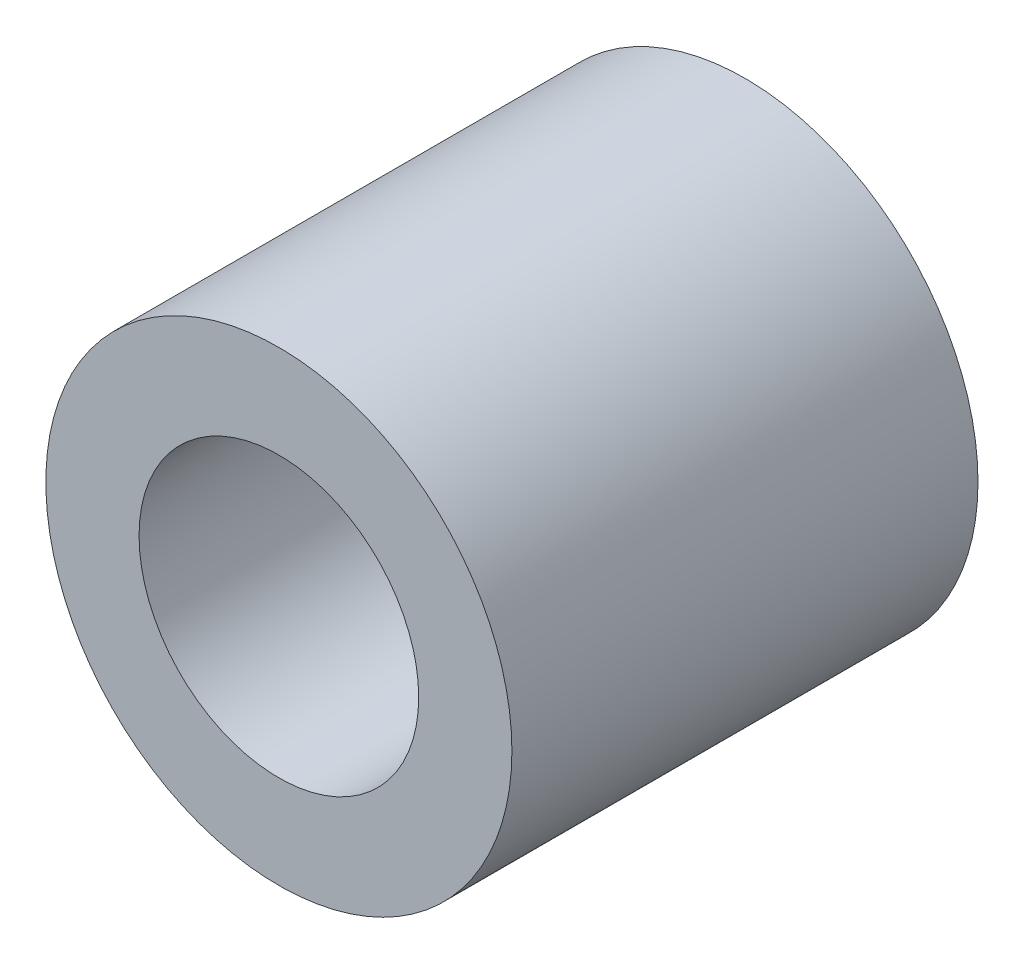
ISO-10303-21;
HEADER;
FILE_DESCRIPTION(('STEP AP214'),'2;1');
FILE_NAME('part.step','',(''),(''),'','','');
FILE_SCHEMA(('AUTOMOTIVE_DESIGN { 1 0 10303 214 1 1 1 1 }'));
ENDSEC;
DATA;
#1=APPLICATION_CONTEXT('core data for automotive mechanical design processes');
#2=APPLICATION_PROTOCOL_DEFINITION('international standard','automotive_design',2000,#1);
#3=PRODUCT_CONTEXT('',#1,'mechanical');
#4=PRODUCT('Part','Part','',(#3));
#5=PRODUCT_RELATED_PRODUCT_CATEGORY('part','',(#4));
#6=PRODUCT_DEFINITION_FORMATION('','',#4);
#7=PRODUCT_DEFINITION_CONTEXT('part definition',#1,'design');
#8=PRODUCT_DEFINITION('design','',#6,#7);
#9=PRODUCT_DEFINITION_SHAPE('','',#8);
#10=(LENGTH_UNIT() NAMED_UNIT(*) SI_UNIT(.MILLI.,.METRE.));
#11=(NAMED_UNIT(*) PLANE_ANGLE_UNIT() SI_UNIT($,.RADIAN.));
#12=(NAMED_UNIT(*) SI_UNIT($,.STERADIAN.) SOLID_ANGLE_UNIT());
#13=UNCERTAINTY_MEASURE_WITH_UNIT(LENGTH_MEASURE(1.E-05),#10,'distance_accuracy_value','');
#14=(GEOMETRIC_REPRESENTATION_CONTEXT(3) GLOBAL_UNCERTAINTY_ASSIGNED_CONTEXT((#13)) GLOBAL_UNIT_ASSIGNED_CONTEXT((#10,
#11,#12)) REPRESENTATION_CONTEXT('',''));
#15=CARTESIAN_POINT('',(0.,0.,0.));
#16=DIRECTION('',(0.,0.,1.));
#17=DIRECTION('',(1.,0.,0.));
#18=AXIS2_PLACEMENT_3D('',#15,#16,#17);
#19=CARTESIAN_POINT('',(0.,0.,10.));
#20=DIRECTION('',(0.,0.,1.));
#21=DIRECTION('',(1.,0.,0.));
#22=AXIS2_PLACEMENT_3D('',#19,#20,#21);
#23=PLANE('',#22);
#24=CARTESIAN_POINT('',(0.,0.,10.));
#25=DIRECTION('',(0.,0.,1.));
#26=DIRECTION('',(1.,0.,0.));
#27=AXIS2_PLACEMENT_3D('',#24,#25,#26);
#28=CIRCLE('',#27,5.);
#29=CARTESIAN_POINT('',(5.,0.,10.));
#30=VERTEX_POINT('',#29);
#31=EDGE_CURVE('E10',#30,#30,#28,.T.);
#32=ORIENTED_EDGE('',*,*,#31,.T.);
#33=EDGE_LOOP('',(#32));
#34=FACE_BOUND('',#33,.T.);
#35=CARTESIAN_POINT('',(0.,0.,10.));
#36=DIRECTION('',(0.,0.,1.));
#37=DIRECTION('',(1.,0.,0.));
#38=AXIS2_PLACEMENT_3D('',#35,#36,#37);
#39=CIRCLE('',#38,3.);
#40=CARTESIAN_POINT('',(3.,0.,10.));
#41=VERTEX_POINT('',#40);
#42=EDGE_CURVE('E41',#41,#41,#39,.T.);
#43=ORIENTED_EDGE('',*,*,#42,.F.);
#44=EDGE_LOOP('',(#43));
#45=FACE_BOUND('',#44,.T.);
#46=ADVANCED_FACE('F30',(#34,#45),#23,.T.);
#47=CARTESIAN_POINT('',(0.,0.,0.));
#48=DIRECTION('',(0.,0.,1.));
#49=DIRECTION('',(1.,0.,0.));
#50=AXIS2_PLACEMENT_3D('',#47,#48,#49);
#51=PLANE('',#50);
#52=CARTESIAN_POINT('',(0.,0.,0.));
#53=DIRECTION('',(0.,0.,1.));
#54=DIRECTION('',(1.,0.,0.));
#55=AXIS2_PLACEMENT_3D('',#52,#53,#54);
#56=CIRCLE('',#55,5.);
#57=CARTESIAN_POINT('',(5.,0.,0.));
#58=VERTEX_POINT('',#57);
#59=EDGE_CURVE('E34',#58,#58,#56,.T.);
#60=ORIENTED_EDGE('',*,*,#59,.F.);
#61=EDGE_LOOP('',(#60));
#62=FACE_BOUND('',#61,.T.);
#63=CARTESIAN_POINT('',(0.,0.,0.));
#64=DIRECTION('',(0.,0.,1.));
#65=DIRECTION('',(1.,0.,0.));
#66=AXIS2_PLACEMENT_3D('',#63,#64,#65);
#67=CIRCLE('',#66,3.);
#68=CARTESIAN_POINT('',(3.,0.,0.));
#69=VERTEX_POINT('',#68);
#70=EDGE_CURVE('E43',#69,#69,#67,.T.);
#71=ORIENTED_EDGE('',*,*,#70,.T.);
#72=EDGE_LOOP('',(#71));
#73=FACE_BOUND('',#72,.T.);
#74=ADVANCED_FACE('F53',(#62,#73),#51,.F.);
#75=CARTESIAN_POINT('',(0.,0.,10.));
#76=DIRECTION('',(0.,0.,-1.));
#77=DIRECTION('',(-1.,0.,0.));
#78=AXIS2_PLACEMENT_3D('',#75,#76,#77);
#79=CYLINDRICAL_SURFACE('',#78,5.);
#80=ORIENTED_EDGE('',*,*,#31,.F.);
#81=EDGE_LOOP('',(#80));
#82=FACE_BOUND('',#81,.T.);
#83=ORIENTED_EDGE('',*,*,#59,.T.);
#84=EDGE_LOOP('',(#83));
#85=FACE_BOUND('',#84,.T.);
#86=ADVANCED_FACE('F32',(#82,#85),#79,.T.);
#87=CARTESIAN_POINT('',(0.,0.,10.));
#88=DIRECTION('',(0.,0.,-1.));
#89=DIRECTION('',(-1.,0.,0.));
#90=AXIS2_PLACEMENT_3D('',#87,#88,#89);
#91=CYLINDRICAL_SURFACE('',#90,3.);
#92=ORIENTED_EDGE('',*,*,#42,.T.);
#93=EDGE_LOOP('',(#92));
#94=FACE_BOUND('',#93,.T.);
#95=ORIENTED_EDGE('',*,*,#70,.F.);
#96=EDGE_LOOP('',(#95));
#97=FACE_BOUND('',#96,.T.);
#98=ADVANCED_FACE('F49',(#94,#97),#91,.F.);
#99=CLOSED_SHELL('',(#46,#74,#86,#98));
#100=MANIFOLD_SOLID_BREP('B2',#99);
#101=ADVANCED_BREP_SHAPE_REPRESENTATION('',(#18,#100),#14);
#102=SHAPE_DEFINITION_REPRESENTATION(#9,#101);
ENDSEC;
END-ISO-10303-21;
